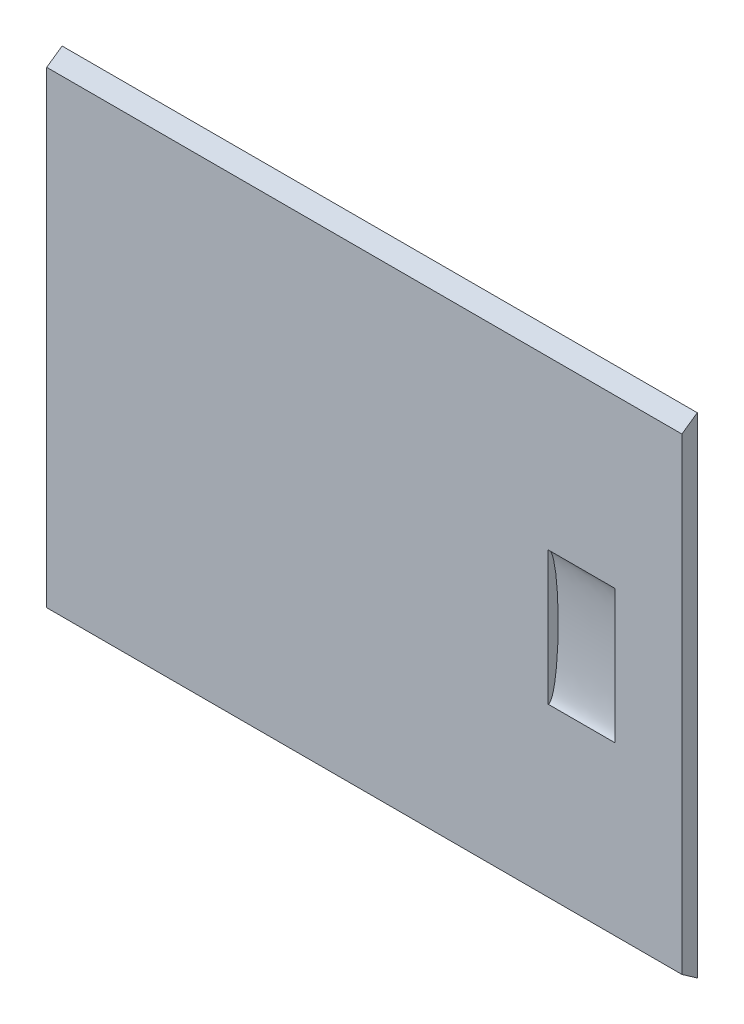
ISO-10303-21;
HEADER;
FILE_DESCRIPTION(('STEP AP214'),'2;1');
FILE_NAME('part.step','',(''),(''),'','','');
FILE_SCHEMA(('AUTOMOTIVE_DESIGN { 1 0 10303 214 1 1 1 1 }'));
ENDSEC;
DATA;
#1=APPLICATION_CONTEXT('core data for automotive mechanical design processes');
#2=APPLICATION_PROTOCOL_DEFINITION('international standard','automotive_design',2000,#1);
#3=PRODUCT_CONTEXT('',#1,'mechanical');
#4=PRODUCT('Part','Part','',(#3));
#5=PRODUCT_RELATED_PRODUCT_CATEGORY('part','',(#4));
#6=PRODUCT_DEFINITION_FORMATION('','',#4);
#7=PRODUCT_DEFINITION_CONTEXT('part definition',#1,'design');
#8=PRODUCT_DEFINITION('design','',#6,#7);
#9=PRODUCT_DEFINITION_SHAPE('','',#8);
#10=(LENGTH_UNIT() NAMED_UNIT(*) SI_UNIT(.MILLI.,.METRE.));
#11=(NAMED_UNIT(*) PLANE_ANGLE_UNIT() SI_UNIT($,.RADIAN.));
#12=(NAMED_UNIT(*) SI_UNIT($,.STERADIAN.) SOLID_ANGLE_UNIT());
#13=UNCERTAINTY_MEASURE_WITH_UNIT(LENGTH_MEASURE(1.E-05),#10,'distance_accuracy_value','');
#14=(GEOMETRIC_REPRESENTATION_CONTEXT(3) GLOBAL_UNCERTAINTY_ASSIGNED_CONTEXT((#13)) GLOBAL_UNIT_ASSIGNED_CONTEXT((#10,
#11,#12)) REPRESENTATION_CONTEXT('',''));
#15=CARTESIAN_POINT('',(0.,0.,0.));
#16=DIRECTION('',(0.,0.,1.));
#17=DIRECTION('',(1.,0.,0.));
#18=AXIS2_PLACEMENT_3D('',#15,#16,#17);
#19=CARTESIAN_POINT('',(190.,0.,2.3));
#20=DIRECTION('',(0.,0.,1.));
#21=DIRECTION('',(1.,0.,0.));
#22=AXIS2_PLACEMENT_3D('',#19,#20,#21);
#23=PLANE('',#22);
#24=DIRECTION('',(0.,1.,0.));
#25=VECTOR('',#24,1.);
#26=CARTESIAN_POINT('',(0.,0.,2.3));
#27=LINE('',#26,#25);
#28=CARTESIAN_POINT('',(0.,-70.,2.3));
#29=VERTEX_POINT('',#28);
#30=CARTESIAN_POINT('',(0.,70.,2.3));
#31=VERTEX_POINT('',#30);
#32=EDGE_CURVE('E123',#29,#31,#27,.T.);
#33=ORIENTED_EDGE('',*,*,#32,.F.);
#34=DIRECTION('',(-1.,0.,0.));
#35=VECTOR('',#34,1.);
#36=CARTESIAN_POINT('',(190.,-70.,2.3));
#37=LINE('',#36,#35);
#38=CARTESIAN_POINT('',(190.,-70.,2.3));
#39=VERTEX_POINT('',#38);
#40=EDGE_CURVE('E80',#39,#29,#37,.T.);
#41=ORIENTED_EDGE('',*,*,#40,.F.);
#42=DIRECTION('',(0.,1.,0.));
#43=VECTOR('',#42,1.);
#44=CARTESIAN_POINT('',(190.,0.,2.3));
#45=LINE('',#44,#43);
#46=CARTESIAN_POINT('',(190.,70.,2.3));
#47=VERTEX_POINT('',#46);
#48=EDGE_CURVE('E117',#39,#47,#45,.T.);
#49=ORIENTED_EDGE('',*,*,#48,.T.);
#50=DIRECTION('',(-1.,0.,0.));
#51=VECTOR('',#50,1.);
#52=CARTESIAN_POINT('',(190.,70.,2.3));
#53=LINE('',#52,#51);
#54=EDGE_CURVE('E57',#47,#31,#53,.T.);
#55=ORIENTED_EDGE('',*,*,#54,.T.);
#56=EDGE_LOOP('',(#33,#41,#49,#55));
#57=FACE_BOUND('',#56,.T.);
#58=DIRECTION('',(1.,0.,0.));
#59=VECTOR('',#58,1.);
#60=CARTESIAN_POINT('',(150.,-19.9966460795764,2.3));
#61=LINE('',#60,#59);
#62=CARTESIAN_POINT('',(150.,-19.9966460795764,2.3));
#63=VERTEX_POINT('',#62);
#64=CARTESIAN_POINT('',(170.,-19.9966460795764,2.3));
#65=VERTEX_POINT('',#64);
#66=EDGE_CURVE('E42',#63,#65,#61,.T.);
#67=ORIENTED_EDGE('',*,*,#66,.F.);
#68=DIRECTION('',(0.,1.,0.));
#69=VECTOR('',#68,1.);
#70=CARTESIAN_POINT('',(150.,0.,2.3));
#71=LINE('',#70,#69);
#72=CARTESIAN_POINT('',(150.,19.9966460795764,2.3));
#73=VERTEX_POINT('',#72);
#74=EDGE_CURVE('E11',#63,#73,#71,.T.);
#75=ORIENTED_EDGE('',*,*,#74,.T.);
#76=DIRECTION('',(1.,0.,0.));
#77=VECTOR('',#76,1.);
#78=CARTESIAN_POINT('',(150.,19.9966460795764,2.3));
#79=LINE('',#78,#77);
#80=CARTESIAN_POINT('',(170.,19.9966460795764,2.3));
#81=VERTEX_POINT('',#80);
#82=EDGE_CURVE('E96',#81,#73,#79,.F.);
#83=ORIENTED_EDGE('',*,*,#82,.F.);
#84=DIRECTION('',(0.,1.,0.));
#85=VECTOR('',#84,1.);
#86=CARTESIAN_POINT('',(170.,0.,2.3));
#87=LINE('',#86,#85);
#88=EDGE_CURVE('E91',#65,#81,#87,.T.);
#89=ORIENTED_EDGE('',*,*,#88,.F.);
#90=EDGE_LOOP('',(#67,#75,#83,#89));
#91=FACE_BOUND('',#90,.T.);
#92=ADVANCED_FACE('F35',(#57,#91),#23,.T.);
#93=CARTESIAN_POINT('',(190.,-48.0513515303029,33.645918562682));
#94=DIRECTION('',(0.,0.819152044288998,-0.573576436351038));
#95=DIRECTION('',(0.,0.573576436351038,0.819152044288998));
#96=AXIS2_PLACEMENT_3D('',#93,#94,#95);
#97=PLANE('',#96);
#98=DIRECTION('',(0.,-0.573576436351038,-0.819152044288998));
#99=VECTOR('',#98,1.);
#100=CARTESIAN_POINT('',(0.,-48.0513515303029,33.645918562682));
#101=LINE('',#100,#99);
#102=CARTESIAN_POINT('',(0.,-73.2209546757646,-2.3));
#103=VERTEX_POINT('',#102);
#104=EDGE_CURVE('E121',#29,#103,#101,.T.);
#105=ORIENTED_EDGE('',*,*,#104,.T.);
#106=DIRECTION('',(-1.,0.,0.));
#107=VECTOR('',#106,1.);
#108=CARTESIAN_POINT('',(190.,-73.2209546757646,-2.3));
#109=LINE('',#108,#107);
#110=CARTESIAN_POINT('',(190.,-73.2209546757646,-2.3));
#111=VERTEX_POINT('',#110);
#112=EDGE_CURVE('E107',#111,#103,#109,.T.);
#113=ORIENTED_EDGE('',*,*,#112,.F.);
#114=DIRECTION('',(0.,-0.573576436351038,-0.819152044288998));
#115=VECTOR('',#114,1.);
#116=CARTESIAN_POINT('',(190.,-48.0513515303029,33.645918562682));
#117=LINE('',#116,#115);
#118=EDGE_CURVE('E128',#39,#111,#117,.T.);
#119=ORIENTED_EDGE('',*,*,#118,.F.);
#120=ORIENTED_EDGE('',*,*,#40,.T.);
#121=EDGE_LOOP('',(#105,#113,#119,#120));
#122=FACE_BOUND('',#121,.T.);
#123=ADVANCED_FACE('F151',(#122),#97,.F.);
#124=CARTESIAN_POINT('',(190.,0.,-2.3));
#125=DIRECTION('',(0.,0.,1.));
#126=DIRECTION('',(1.,0.,0.));
#127=AXIS2_PLACEMENT_3D('',#124,#125,#126);
#128=PLANE('',#127);
#129=DIRECTION('',(0.,1.,0.));
#130=VECTOR('',#129,1.);
#131=CARTESIAN_POINT('',(0.,0.,-2.3));
#132=LINE('',#131,#130);
#133=CARTESIAN_POINT('',(0.,73.2209546757646,-2.3));
#134=VERTEX_POINT('',#133);
#135=EDGE_CURVE('E118',#103,#134,#132,.T.);
#136=ORIENTED_EDGE('',*,*,#135,.T.);
#137=DIRECTION('',(-1.,0.,0.));
#138=VECTOR('',#137,1.);
#139=CARTESIAN_POINT('',(190.,73.2209546757646,-2.3));
#140=LINE('',#139,#138);
#141=CARTESIAN_POINT('',(190.,73.2209546757646,-2.3));
#142=VERTEX_POINT('',#141);
#143=EDGE_CURVE('E110',#142,#134,#140,.T.);
#144=ORIENTED_EDGE('',*,*,#143,.F.);
#145=DIRECTION('',(0.,1.,0.));
#146=VECTOR('',#145,1.);
#147=CARTESIAN_POINT('',(190.,0.,-2.3));
#148=LINE('',#147,#146);
#149=EDGE_CURVE('E126',#111,#142,#148,.T.);
#150=ORIENTED_EDGE('',*,*,#149,.F.);
#151=ORIENTED_EDGE('',*,*,#112,.T.);
#152=EDGE_LOOP('',(#136,#144,#150,#151));
#153=FACE_BOUND('',#152,.T.);
#154=ADVANCED_FACE('F149',(#153),#128,.F.);
#155=CARTESIAN_POINT('',(190.,48.0513515303026,33.6459185626821));
#156=DIRECTION('',(0.,0.819152044288995,0.573576436351041));
#157=DIRECTION('',(0.,-0.573576436351041,0.819152044288995));
#158=AXIS2_PLACEMENT_3D('',#155,#156,#157);
#159=PLANE('',#158);
#160=DIRECTION('',(0.,0.573576436351041,-0.819152044288995));
#161=VECTOR('',#160,1.);
#162=CARTESIAN_POINT('',(0.,48.0513515303026,33.6459185626821));
#163=LINE('',#162,#161);
#164=EDGE_CURVE('E114',#31,#134,#163,.T.);
#165=ORIENTED_EDGE('',*,*,#164,.F.);
#166=ORIENTED_EDGE('',*,*,#54,.F.);
#167=DIRECTION('',(0.,0.573576436351041,-0.819152044288995));
#168=VECTOR('',#167,1.);
#169=CARTESIAN_POINT('',(190.,48.0513515303026,33.6459185626821));
#170=LINE('',#169,#168);
#171=EDGE_CURVE('E113',#47,#142,#170,.T.);
#172=ORIENTED_EDGE('',*,*,#171,.T.);
#173=ORIENTED_EDGE('',*,*,#143,.T.);
#174=EDGE_LOOP('',(#165,#166,#172,#173));
#175=FACE_BOUND('',#174,.T.);
#176=ADVANCED_FACE('F142',(#175),#159,.T.);
#177=CARTESIAN_POINT('',(190.,0.,0.));
#178=DIRECTION('',(1.,0.,0.));
#179=DIRECTION('',(0.,0.,-1.));
#180=AXIS2_PLACEMENT_3D('',#177,#178,#179);
#181=PLANE('',#180);
#182=ORIENTED_EDGE('',*,*,#48,.F.);
#183=ORIENTED_EDGE('',*,*,#118,.T.);
#184=ORIENTED_EDGE('',*,*,#149,.T.);
#185=ORIENTED_EDGE('',*,*,#171,.F.);
#186=EDGE_LOOP('',(#182,#183,#184,#185));
#187=FACE_BOUND('',#186,.T.);
#188=ADVANCED_FACE('F139',(#187),#181,.T.);
#189=CARTESIAN_POINT('',(0.,0.,0.));
#190=DIRECTION('',(1.,0.,0.));
#191=DIRECTION('',(0.,0.,-1.));
#192=AXIS2_PLACEMENT_3D('',#189,#190,#191);
#193=PLANE('',#192);
#194=ORIENTED_EDGE('',*,*,#32,.T.);
#195=ORIENTED_EDGE('',*,*,#164,.T.);
#196=ORIENTED_EDGE('',*,*,#135,.F.);
#197=ORIENTED_EDGE('',*,*,#104,.F.);
#198=EDGE_LOOP('',(#194,#195,#196,#197));
#199=FACE_BOUND('',#198,.T.);
#200=ADVANCED_FACE('F137',(#199),#193,.F.);
#201=CARTESIAN_POINT('',(150.,0.,2.3));
#202=DIRECTION('',(1.,0.,0.));
#203=DIRECTION('',(0.,-0.999996048012779,-0.00281139801940611));
#204=AXIS2_PLACEMENT_3D('',#201,#202,#203);
#205=ELLIPSE('',#204,20.0000790400568,3.00001185600851);
#206=DIRECTION('',(1.,0.,0.));
#207=VECTOR('',#206,1.);
#208=SURFACE_OF_LINEAR_EXTRUSION('',#205,#207);
#209=ORIENTED_EDGE('',*,*,#66,.T.);
#210=CARTESIAN_POINT('',(170.,0.,2.3));
#211=DIRECTION('',(1.,0.,0.));
#212=DIRECTION('',(0.,-0.999996048012779,-0.00281139801940611));
#213=AXIS2_PLACEMENT_3D('',#210,#211,#212);
#214=ELLIPSE('',#213,20.0000790400568,3.00001185600851);
#215=EDGE_CURVE('E48',#65,#81,#214,.T.);
#216=ORIENTED_EDGE('',*,*,#215,.T.);
#217=ORIENTED_EDGE('',*,*,#82,.T.);
#218=EDGE_CURVE('E102',#63,#73,#205,.T.);
#219=ORIENTED_EDGE('',*,*,#218,.F.);
#220=EDGE_LOOP('',(#209,#216,#217,#219));
#221=FACE_BOUND('',#220,.T.);
#222=ADVANCED_FACE('F99',(#221),#208,.F.);
#223=CARTESIAN_POINT('',(150.,0.,2.3));
#224=DIRECTION('',(1.,0.,0.));
#225=DIRECTION('',(0.,0.,-1.));
#226=AXIS2_PLACEMENT_3D('',#223,#224,#225);
#227=PLANE('',#226);
#228=ORIENTED_EDGE('',*,*,#218,.T.);
#229=ORIENTED_EDGE('',*,*,#74,.F.);
#230=EDGE_LOOP('',(#228,#229));
#231=FACE_BOUND('',#230,.T.);
#232=ADVANCED_FACE('F136',(#231),#227,.T.);
#233=CARTESIAN_POINT('',(170.,0.,2.3));
#234=DIRECTION('',(1.,0.,0.));
#235=DIRECTION('',(0.,0.,-1.));
#236=AXIS2_PLACEMENT_3D('',#233,#234,#235);
#237=PLANE('',#236);
#238=ORIENTED_EDGE('',*,*,#88,.T.);
#239=ORIENTED_EDGE('',*,*,#215,.F.);
#240=EDGE_LOOP('',(#238,#239));
#241=FACE_BOUND('',#240,.T.);
#242=ADVANCED_FACE('F92',(#241),#237,.F.);
#243=CLOSED_SHELL('',(#92,#123,#154,#176,#188,#200,#222,#232,#242));
#244=MANIFOLD_SOLID_BREP('B2',#243);
#245=ADVANCED_BREP_SHAPE_REPRESENTATION('',(#18,#244),#14);
#246=SHAPE_DEFINITION_REPRESENTATION(#9,#245);
ENDSEC;
END-ISO-10303-21;
